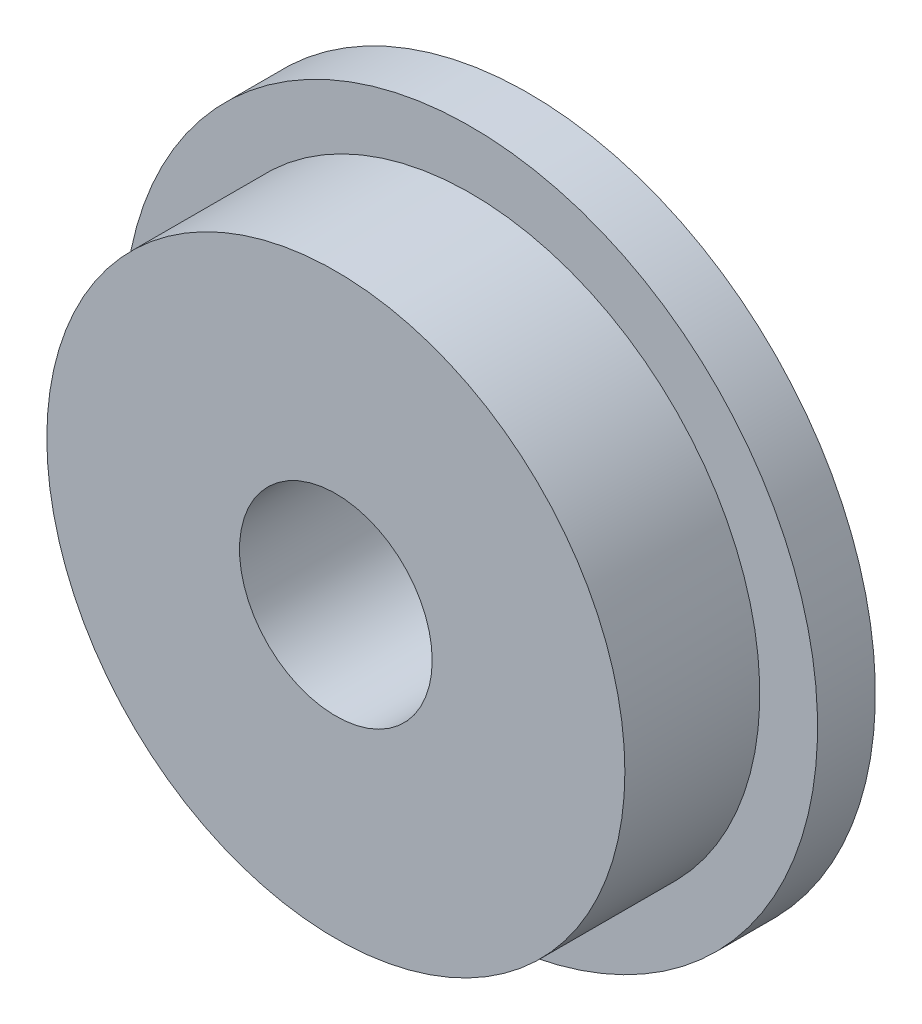
ISO-10303-21;
HEADER;
FILE_DESCRIPTION(('STEP AP214'),'2;1');
FILE_NAME('part.step','',(''),(''),'','','');
FILE_SCHEMA(('AUTOMOTIVE_DESIGN { 1 0 10303 214 1 1 1 1 }'));
ENDSEC;
DATA;
#1=APPLICATION_CONTEXT('core data for automotive mechanical design processes');
#2=APPLICATION_PROTOCOL_DEFINITION('international standard','automotive_design',2000,#1);
#3=PRODUCT_CONTEXT('',#1,'mechanical');
#4=PRODUCT('Part','Part','',(#3));
#5=PRODUCT_RELATED_PRODUCT_CATEGORY('part','',(#4));
#6=PRODUCT_DEFINITION_FORMATION('','',#4);
#7=PRODUCT_DEFINITION_CONTEXT('part definition',#1,'design');
#8=PRODUCT_DEFINITION('design','',#6,#7);
#9=PRODUCT_DEFINITION_SHAPE('','',#8);
#10=(LENGTH_UNIT() NAMED_UNIT(*) SI_UNIT(.MILLI.,.METRE.));
#11=(NAMED_UNIT(*) PLANE_ANGLE_UNIT() SI_UNIT($,.RADIAN.));
#12=(NAMED_UNIT(*) SI_UNIT($,.STERADIAN.) SOLID_ANGLE_UNIT());
#13=UNCERTAINTY_MEASURE_WITH_UNIT(LENGTH_MEASURE(1.E-05),#10,'distance_accuracy_value','');
#14=(GEOMETRIC_REPRESENTATION_CONTEXT(3) GLOBAL_UNCERTAINTY_ASSIGNED_CONTEXT((#13)) GLOBAL_UNIT_ASSIGNED_CONTEXT((#10,
#11,#12)) REPRESENTATION_CONTEXT('',''));
#15=CARTESIAN_POINT('',(0.,0.,0.));
#16=DIRECTION('',(0.,0.,1.));
#17=DIRECTION('',(1.,0.,0.));
#18=AXIS2_PLACEMENT_3D('',#15,#16,#17);
#19=CARTESIAN_POINT('',(0.,0.,2.));
#20=DIRECTION('',(0.,0.,-1.));
#21=DIRECTION('',(-1.,0.,0.));
#22=AXIS2_PLACEMENT_3D('',#19,#20,#21);
#23=CYLINDRICAL_SURFACE('',#22,3.);
#24=CARTESIAN_POINT('',(0.,0.,2.));
#25=DIRECTION('',(0.,0.,1.));
#26=DIRECTION('',(1.,0.,0.));
#27=AXIS2_PLACEMENT_3D('',#24,#25,#26);
#28=CIRCLE('',#27,3.);
#29=CARTESIAN_POINT('',(3.,0.,2.));
#30=VERTEX_POINT('',#29);
#31=EDGE_CURVE('E46',#30,#30,#28,.T.);
#32=ORIENTED_EDGE('',*,*,#31,.F.);
#33=EDGE_LOOP('',(#32));
#34=FACE_BOUND('',#33,.T.);
#35=CARTESIAN_POINT('',(0.,0.,0.6));
#36=DIRECTION('',(0.,0.,-1.));
#37=DIRECTION('',(-1.,0.,0.));
#38=AXIS2_PLACEMENT_3D('',#35,#36,#37);
#39=CIRCLE('',#38,3.);
#40=CARTESIAN_POINT('',(-3.,0.,0.6));
#41=VERTEX_POINT('',#40);
#42=EDGE_CURVE('E10',#41,#41,#39,.T.);
#43=ORIENTED_EDGE('',*,*,#42,.F.);
#44=EDGE_LOOP('',(#43));
#45=FACE_BOUND('',#44,.T.);
#46=ADVANCED_FACE('F39',(#34,#45),#23,.T.);
#47=CARTESIAN_POINT('',(0.,0.,2.));
#48=DIRECTION('',(0.,0.,1.));
#49=DIRECTION('',(1.,0.,0.));
#50=AXIS2_PLACEMENT_3D('',#47,#48,#49);
#51=PLANE('',#50);
#52=CARTESIAN_POINT('',(0.,0.,2.));
#53=DIRECTION('',(0.,0.,1.));
#54=DIRECTION('',(1.,0.,0.));
#55=AXIS2_PLACEMENT_3D('',#52,#53,#54);
#56=CIRCLE('',#55,1.);
#57=CARTESIAN_POINT('',(1.,0.,2.));
#58=VERTEX_POINT('',#57);
#59=EDGE_CURVE('E61',#58,#58,#56,.T.);
#60=ORIENTED_EDGE('',*,*,#59,.F.);
#61=EDGE_LOOP('',(#60));
#62=FACE_BOUND('',#61,.T.);
#63=ORIENTED_EDGE('',*,*,#31,.T.);
#64=EDGE_LOOP('',(#63));
#65=FACE_BOUND('',#64,.T.);
#66=ADVANCED_FACE('F84',(#62,#65),#51,.T.);
#67=CARTESIAN_POINT('',(0.,0.,0.6));
#68=DIRECTION('',(0.,0.,-1.));
#69=DIRECTION('',(-1.,0.,0.));
#70=AXIS2_PLACEMENT_3D('',#67,#68,#69);
#71=CYLINDRICAL_SURFACE('',#70,3.6);
#72=CARTESIAN_POINT('',(0.,0.,0.6));
#73=DIRECTION('',(0.,0.,-1.));
#74=DIRECTION('',(-1.,0.,0.));
#75=AXIS2_PLACEMENT_3D('',#72,#73,#74);
#76=CIRCLE('',#75,3.6);
#77=CARTESIAN_POINT('',(-3.6,0.,0.6));
#78=VERTEX_POINT('',#77);
#79=EDGE_CURVE('E51',#78,#78,#76,.T.);
#80=ORIENTED_EDGE('',*,*,#79,.T.);
#81=EDGE_LOOP('',(#80));
#82=FACE_BOUND('',#81,.T.);
#83=CARTESIAN_POINT('',(0.,0.,0.));
#84=DIRECTION('',(0.,0.,-1.));
#85=DIRECTION('',(-1.,0.,0.));
#86=AXIS2_PLACEMENT_3D('',#83,#84,#85);
#87=CIRCLE('',#86,3.6);
#88=CARTESIAN_POINT('',(-3.6,0.,0.));
#89=VERTEX_POINT('',#88);
#90=EDGE_CURVE('E56',#89,#89,#87,.T.);
#91=ORIENTED_EDGE('',*,*,#90,.F.);
#92=EDGE_LOOP('',(#91));
#93=FACE_BOUND('',#92,.T.);
#94=ADVANCED_FACE('F89',(#82,#93),#71,.T.);
#95=CARTESIAN_POINT('',(0.,0.,0.6));
#96=DIRECTION('',(0.,0.,-1.));
#97=DIRECTION('',(-1.,0.,0.));
#98=AXIS2_PLACEMENT_3D('',#95,#96,#97);
#99=PLANE('',#98);
#100=ORIENTED_EDGE('',*,*,#42,.T.);
#101=EDGE_LOOP('',(#100));
#102=FACE_BOUND('',#101,.T.);
#103=ORIENTED_EDGE('',*,*,#79,.F.);
#104=EDGE_LOOP('',(#103));
#105=FACE_BOUND('',#104,.T.);
#106=ADVANCED_FACE('F81',(#102,#105),#99,.F.);
#107=CARTESIAN_POINT('',(0.,0.,0.));
#108=DIRECTION('',(0.,0.,1.));
#109=DIRECTION('',(1.,0.,0.));
#110=AXIS2_PLACEMENT_3D('',#107,#108,#109);
#111=PLANE('',#110);
#112=CARTESIAN_POINT('',(0.,0.,0.));
#113=DIRECTION('',(0.,0.,1.));
#114=DIRECTION('',(1.,0.,0.));
#115=AXIS2_PLACEMENT_3D('',#112,#113,#114);
#116=CIRCLE('',#115,1.);
#117=CARTESIAN_POINT('',(1.,0.,0.));
#118=VERTEX_POINT('',#117);
#119=EDGE_CURVE('E66',#118,#118,#116,.T.);
#120=ORIENTED_EDGE('',*,*,#119,.T.);
#121=EDGE_LOOP('',(#120));
#122=FACE_BOUND('',#121,.T.);
#123=ORIENTED_EDGE('',*,*,#90,.T.);
#124=EDGE_LOOP('',(#123));
#125=FACE_BOUND('',#124,.T.);
#126=ADVANCED_FACE('F71',(#122,#125),#111,.F.);
#127=CARTESIAN_POINT('',(0.,0.,0.));
#128=DIRECTION('',(0.,0.,1.));
#129=DIRECTION('',(1.,0.,0.));
#130=AXIS2_PLACEMENT_3D('',#127,#128,#129);
#131=CYLINDRICAL_SURFACE('',#130,1.);
#132=ORIENTED_EDGE('',*,*,#59,.T.);
#133=EDGE_LOOP('',(#132));
#134=FACE_BOUND('',#133,.T.);
#135=ORIENTED_EDGE('',*,*,#119,.F.);
#136=EDGE_LOOP('',(#135));
#137=FACE_BOUND('',#136,.T.);
#138=ADVANCED_FACE('F74',(#134,#137),#131,.F.);
#139=CLOSED_SHELL('',(#46,#66,#94,#106,#126,#138));
#140=MANIFOLD_SOLID_BREP('B2',#139);
#141=ADVANCED_BREP_SHAPE_REPRESENTATION('',(#18,#140),#14);
#142=SHAPE_DEFINITION_REPRESENTATION(#9,#141);
ENDSEC;
END-ISO-10303-21;
